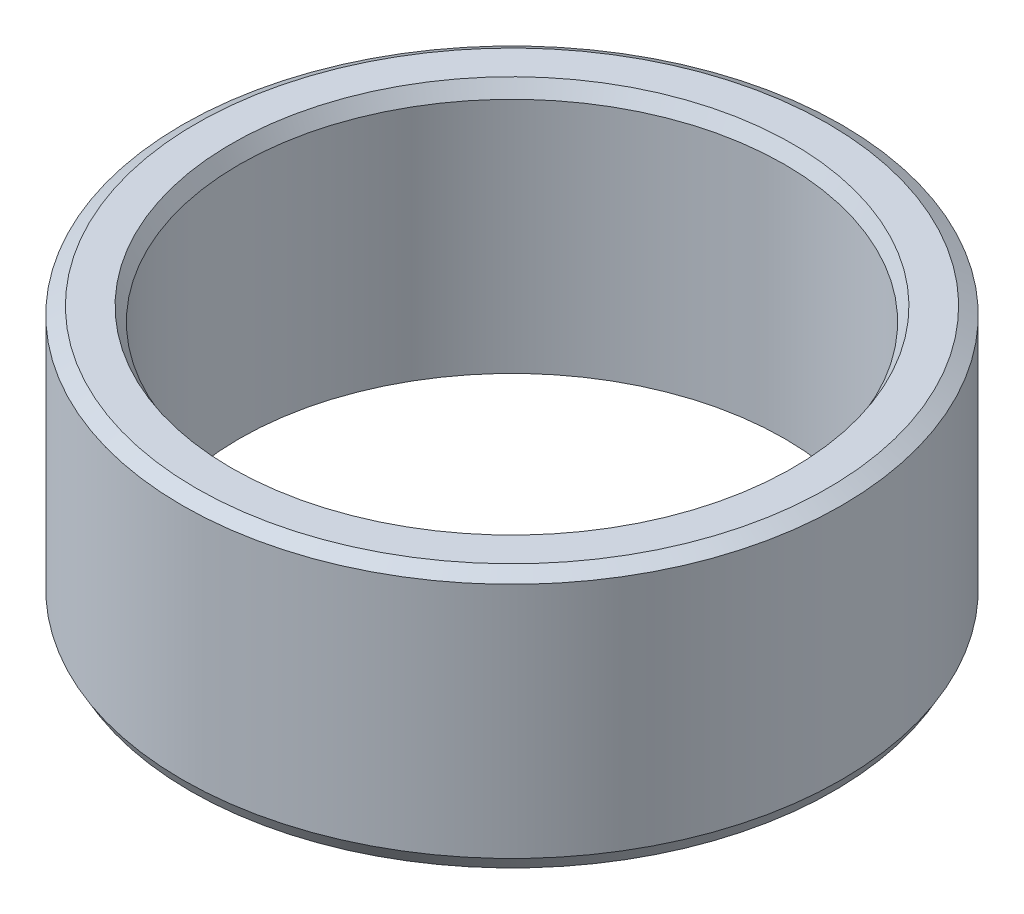
ISO-10303-21;
HEADER;
FILE_DESCRIPTION(('STEP AP214'),'2;1');
FILE_NAME('part.step','',(''),(''),'','','');
FILE_SCHEMA(('AUTOMOTIVE_DESIGN { 1 0 10303 214 1 1 1 1 }'));
ENDSEC;
DATA;
#1=APPLICATION_CONTEXT('core data for automotive mechanical design processes');
#2=APPLICATION_PROTOCOL_DEFINITION('international standard','automotive_design',2000,#1);
#3=PRODUCT_CONTEXT('',#1,'mechanical');
#4=PRODUCT('Part','Part','',(#3));
#5=PRODUCT_RELATED_PRODUCT_CATEGORY('part','',(#4));
#6=PRODUCT_DEFINITION_FORMATION('','',#4);
#7=PRODUCT_DEFINITION_CONTEXT('part definition',#1,'design');
#8=PRODUCT_DEFINITION('design','',#6,#7);
#9=PRODUCT_DEFINITION_SHAPE('','',#8);
#10=(LENGTH_UNIT() NAMED_UNIT(*) SI_UNIT(.MILLI.,.METRE.));
#11=(NAMED_UNIT(*) PLANE_ANGLE_UNIT() SI_UNIT($,.RADIAN.));
#12=(NAMED_UNIT(*) SI_UNIT($,.STERADIAN.) SOLID_ANGLE_UNIT());
#13=UNCERTAINTY_MEASURE_WITH_UNIT(LENGTH_MEASURE(1.E-05),#10,'distance_accuracy_value','');
#14=(GEOMETRIC_REPRESENTATION_CONTEXT(3) GLOBAL_UNCERTAINTY_ASSIGNED_CONTEXT((#13)) GLOBAL_UNIT_ASSIGNED_CONTEXT((#10,
#11,#12)) REPRESENTATION_CONTEXT('',''));
#15=CARTESIAN_POINT('',(0.,0.,0.));
#16=DIRECTION('',(0.,0.,1.));
#17=DIRECTION('',(1.,0.,0.));
#18=AXIS2_PLACEMENT_3D('',#15,#16,#17);
#19=CARTESIAN_POINT('',(0.,41.2903860953938,0.));
#20=DIRECTION('',(0.,-1.,0.));
#21=DIRECTION('',(0.,0.,-1.));
#22=AXIS2_PLACEMENT_3D('',#19,#20,#21);
#23=CYLINDRICAL_SURFACE('',#22,52.5);
#24=CARTESIAN_POINT('',(0.,2.20845812293831,0.));
#25=DIRECTION('',(0.,1.,0.));
#26=DIRECTION('',(0.,0.,1.));
#27=AXIS2_PLACEMENT_3D('',#24,#25,#26);
#28=CIRCLE('',#27,52.5);
#29=CARTESIAN_POINT('',(0.,2.20845812293831,52.5));
#30=VERTEX_POINT('',#29);
#31=EDGE_CURVE('E10',#30,#30,#28,.T.);
#32=ORIENTED_EDGE('',*,*,#31,.T.);
#33=EDGE_LOOP('',(#32));
#34=FACE_BOUND('',#33,.T.);
#35=CARTESIAN_POINT('',(0.,40.0153322036214,0.));
#36=DIRECTION('',(0.,1.,0.));
#37=DIRECTION('',(0.,0.,1.));
#38=AXIS2_PLACEMENT_3D('',#35,#36,#37);
#39=CIRCLE('',#38,52.5);
#40=CARTESIAN_POINT('',(0.,40.0153322036214,52.5));
#41=VERTEX_POINT('',#40);
#42=EDGE_CURVE('E50',#41,#41,#39,.F.);
#43=ORIENTED_EDGE('',*,*,#42,.T.);
#44=EDGE_LOOP('',(#43));
#45=FACE_BOUND('',#44,.T.);
#46=ADVANCED_FACE('F39',(#34,#45),#23,.T.);
#47=CARTESIAN_POINT('',(0.,41.2903860953938,0.));
#48=DIRECTION('',(0.,1.,0.));
#49=DIRECTION('',(0.,0.,1.));
#50=AXIS2_PLACEMENT_3D('',#47,#48,#49);
#51=PLANE('',#50);
#52=CARTESIAN_POINT('',(0.,41.2903860953938,0.));
#53=DIRECTION('',(0.,1.,0.));
#54=DIRECTION('',(0.,0.,1.));
#55=AXIS2_PLACEMENT_3D('',#52,#53,#54);
#56=CIRCLE('',#55,44.6969904186578);
#57=CARTESIAN_POINT('',(0.,41.2903860953938,44.6969904186578));
#58=VERTEX_POINT('',#57);
#59=EDGE_CURVE('E58',#58,#58,#56,.F.);
#60=ORIENTED_EDGE('',*,*,#59,.T.);
#61=EDGE_LOOP('',(#60));
#62=FACE_BOUND('',#61,.T.);
#63=CARTESIAN_POINT('',(0.,41.2903860953938,0.));
#64=DIRECTION('',(0.,1.,0.));
#65=DIRECTION('',(0.,0.,1.));
#66=AXIS2_PLACEMENT_3D('',#63,#64,#65);
#67=CIRCLE('',#66,50.2915418770618);
#68=CARTESIAN_POINT('',(0.,41.2903860953938,50.2915418770618));
#69=VERTEX_POINT('',#68);
#70=EDGE_CURVE('E61',#69,#69,#67,.T.);
#71=ORIENTED_EDGE('',*,*,#70,.T.);
#72=EDGE_LOOP('',(#71));
#73=FACE_BOUND('',#72,.T.);
#74=ADVANCED_FACE('F88',(#62,#73),#51,.T.);
#75=CARTESIAN_POINT('',(0.,0.,0.));
#76=DIRECTION('',(0.,1.,0.));
#77=DIRECTION('',(0.,0.,1.));
#78=AXIS2_PLACEMENT_3D('',#75,#76,#77);
#79=PLANE('',#78);
#80=CARTESIAN_POINT('',(0.,0.,0.));
#81=DIRECTION('',(0.,1.,0.));
#82=DIRECTION('',(0.,0.,1.));
#83=AXIS2_PLACEMENT_3D('',#80,#81,#82);
#84=CIRCLE('',#83,45.6303946498236);
#85=CARTESIAN_POINT('',(0.,0.,45.6303946498236));
#86=VERTEX_POINT('',#85);
#87=EDGE_CURVE('E51',#86,#86,#84,.T.);
#88=ORIENTED_EDGE('',*,*,#87,.T.);
#89=EDGE_LOOP('',(#88));
#90=FACE_BOUND('',#89,.T.);
#91=CARTESIAN_POINT('',(0.,0.,0.));
#92=DIRECTION('',(0.,1.,0.));
#93=DIRECTION('',(0.,0.,1.));
#94=AXIS2_PLACEMENT_3D('',#91,#92,#93);
#95=CIRCLE('',#94,51.2249461082275);
#96=CARTESIAN_POINT('',(0.,0.,51.2249461082275));
#97=VERTEX_POINT('',#96);
#98=EDGE_CURVE('E54',#97,#97,#95,.F.);
#99=ORIENTED_EDGE('',*,*,#98,.T.);
#100=EDGE_LOOP('',(#99));
#101=FACE_BOUND('',#100,.T.);
#102=ADVANCED_FACE('F83',(#90,#101),#79,.F.);
#103=CARTESIAN_POINT('',(0.,41.2903860953938,0.));
#104=DIRECTION('',(0.,-1.,0.));
#105=DIRECTION('',(0.,0.,-1.));
#106=AXIS2_PLACEMENT_3D('',#103,#104,#105);
#107=CYLINDRICAL_SURFACE('',#106,43.4219365268853);
#108=CARTESIAN_POINT('',(0.,39.0819279724555,0.));
#109=DIRECTION('',(0.,1.,0.));
#110=DIRECTION('',(0.,0.,1.));
#111=AXIS2_PLACEMENT_3D('',#108,#109,#110);
#112=CIRCLE('',#111,43.4219365268853);
#113=CARTESIAN_POINT('',(0.,39.0819279724555,43.4219365268853));
#114=VERTEX_POINT('',#113);
#115=EDGE_CURVE('E67',#114,#114,#112,.T.);
#116=ORIENTED_EDGE('',*,*,#115,.T.);
#117=EDGE_LOOP('',(#116));
#118=FACE_BOUND('',#117,.T.);
#119=CARTESIAN_POINT('',(0.,1.27505389177244,0.));
#120=DIRECTION('',(0.,1.,0.));
#121=DIRECTION('',(0.,0.,1.));
#122=AXIS2_PLACEMENT_3D('',#119,#120,#121);
#123=CIRCLE('',#122,43.4219365268853);
#124=CARTESIAN_POINT('',(0.,1.27505389177244,43.4219365268853));
#125=VERTEX_POINT('',#124);
#126=EDGE_CURVE('E69',#125,#125,#123,.F.);
#127=ORIENTED_EDGE('',*,*,#126,.T.);
#128=EDGE_LOOP('',(#127));
#129=FACE_BOUND('',#128,.T.);
#130=ADVANCED_FACE('F71',(#118,#129),#107,.F.);
#131=CARTESIAN_POINT('',(0.,39.0819279724555,0.));
#132=DIRECTION('',(0.,1.,0.));
#133=DIRECTION('',(0.,0.,1.));
#134=AXIS2_PLACEMENT_3D('',#131,#132,#133);
#135=CONICAL_SURFACE('',#134,43.4219365268853,0.523598775598308);
#136=ORIENTED_EDGE('',*,*,#59,.F.);
#137=EDGE_LOOP('',(#136));
#138=FACE_BOUND('',#137,.T.);
#139=ORIENTED_EDGE('',*,*,#115,.F.);
#140=EDGE_LOOP('',(#139));
#141=FACE_BOUND('',#140,.T.);
#142=ADVANCED_FACE('F77',(#138,#141),#135,.F.);
#143=CARTESIAN_POINT('',(0.,0.,0.));
#144=DIRECTION('',(0.,-1.,0.));
#145=DIRECTION('',(0.,0.,-1.));
#146=AXIS2_PLACEMENT_3D('',#143,#144,#145);
#147=CONICAL_SURFACE('',#146,45.6303946498236,1.0471975511966);
#148=ORIENTED_EDGE('',*,*,#126,.F.);
#149=EDGE_LOOP('',(#148));
#150=FACE_BOUND('',#149,.T.);
#151=ORIENTED_EDGE('',*,*,#87,.F.);
#152=EDGE_LOOP('',(#151));
#153=FACE_BOUND('',#152,.T.);
#154=ADVANCED_FACE('F73',(#150,#153),#147,.F.);
#155=CARTESIAN_POINT('',(0.,2.20845812293831,0.));
#156=DIRECTION('',(0.,1.,0.));
#157=DIRECTION('',(0.,0.,1.));
#158=AXIS2_PLACEMENT_3D('',#155,#156,#157);
#159=CONICAL_SURFACE('',#158,52.5,0.5235987755983);
#160=ORIENTED_EDGE('',*,*,#98,.F.);
#161=EDGE_LOOP('',(#160));
#162=FACE_BOUND('',#161,.T.);
#163=ORIENTED_EDGE('',*,*,#31,.F.);
#164=EDGE_LOOP('',(#163));
#165=FACE_BOUND('',#164,.T.);
#166=ADVANCED_FACE('F76',(#162,#165),#159,.T.);
#167=CARTESIAN_POINT('',(0.,41.2903860953938,0.));
#168=DIRECTION('',(0.,-1.,0.));
#169=DIRECTION('',(0.,0.,-1.));
#170=AXIS2_PLACEMENT_3D('',#167,#168,#169);
#171=CONICAL_SURFACE('',#170,50.2915418770618,1.0471975511966);
#172=ORIENTED_EDGE('',*,*,#42,.F.);
#173=EDGE_LOOP('',(#172));
#174=FACE_BOUND('',#173,.T.);
#175=ORIENTED_EDGE('',*,*,#70,.F.);
#176=EDGE_LOOP('',(#175));
#177=FACE_BOUND('',#176,.T.);
#178=ADVANCED_FACE('F45',(#174,#177),#171,.T.);
#179=CLOSED_SHELL('',(#46,#74,#102,#130,#142,#154,#166,#178));
#180=MANIFOLD_SOLID_BREP('B2',#179);
#181=ADVANCED_BREP_SHAPE_REPRESENTATION('',(#18,#180),#14);
#182=SHAPE_DEFINITION_REPRESENTATION(#9,#181);
ENDSEC;
END-ISO-10303-21;
